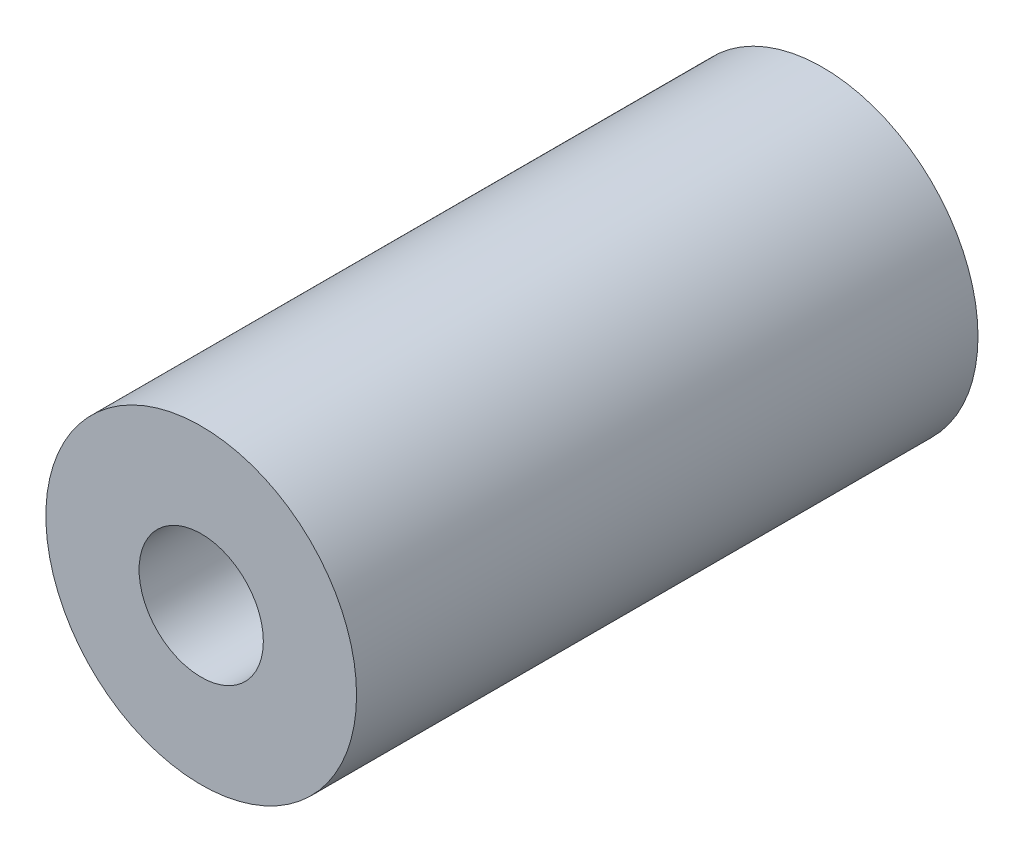
ISO-10303-21;
HEADER;
FILE_DESCRIPTION(('STEP AP214'),'2;1');
FILE_NAME('part.step','',(''),(''),'','','');
FILE_SCHEMA(('AUTOMOTIVE_DESIGN { 1 0 10303 214 1 1 1 1 }'));
ENDSEC;
DATA;
#1=APPLICATION_CONTEXT('core data for automotive mechanical design processes');
#2=APPLICATION_PROTOCOL_DEFINITION('international standard','automotive_design',2000,#1);
#3=PRODUCT_CONTEXT('',#1,'mechanical');
#4=PRODUCT('Part','Part','',(#3));
#5=PRODUCT_RELATED_PRODUCT_CATEGORY('part','',(#4));
#6=PRODUCT_DEFINITION_FORMATION('','',#4);
#7=PRODUCT_DEFINITION_CONTEXT('part definition',#1,'design');
#8=PRODUCT_DEFINITION('design','',#6,#7);
#9=PRODUCT_DEFINITION_SHAPE('','',#8);
#10=(LENGTH_UNIT() NAMED_UNIT(*) SI_UNIT(.MILLI.,.METRE.));
#11=(NAMED_UNIT(*) PLANE_ANGLE_UNIT() SI_UNIT($,.RADIAN.));
#12=(NAMED_UNIT(*) SI_UNIT($,.STERADIAN.) SOLID_ANGLE_UNIT());
#13=UNCERTAINTY_MEASURE_WITH_UNIT(LENGTH_MEASURE(1.E-05),#10,'distance_accuracy_value','');
#14=(GEOMETRIC_REPRESENTATION_CONTEXT(3) GLOBAL_UNCERTAINTY_ASSIGNED_CONTEXT((#13)) GLOBAL_UNIT_ASSIGNED_CONTEXT((#10,
#11,#12)) REPRESENTATION_CONTEXT('',''));
#15=CARTESIAN_POINT('',(0.,0.,0.));
#16=DIRECTION('',(0.,0.,1.));
#17=DIRECTION('',(1.,0.,0.));
#18=AXIS2_PLACEMENT_3D('',#15,#16,#17);
#19=CARTESIAN_POINT('',(0.,0.,31.75));
#20=DIRECTION('',(0.,0.,-1.));
#21=DIRECTION('',(-1.,0.,0.));
#22=AXIS2_PLACEMENT_3D('',#19,#20,#21);
#23=CYLINDRICAL_SURFACE('',#22,3.175);
#24=CARTESIAN_POINT('',(0.,0.,31.75));
#25=DIRECTION('',(0.,0.,1.));
#26=DIRECTION('',(1.,0.,0.));
#27=AXIS2_PLACEMENT_3D('',#24,#25,#26);
#28=CIRCLE('',#27,3.175);
#29=CARTESIAN_POINT('',(3.175,0.,31.75));
#30=VERTEX_POINT('',#29);
#31=EDGE_CURVE('E39',#30,#30,#28,.T.);
#32=ORIENTED_EDGE('',*,*,#31,.T.);
#33=EDGE_LOOP('',(#32));
#34=FACE_BOUND('',#33,.T.);
#35=CARTESIAN_POINT('',(0.,0.,0.));
#36=DIRECTION('',(0.,0.,1.));
#37=DIRECTION('',(1.,0.,0.));
#38=AXIS2_PLACEMENT_3D('',#35,#36,#37);
#39=CIRCLE('',#38,3.175);
#40=CARTESIAN_POINT('',(3.175,0.,0.));
#41=VERTEX_POINT('',#40);
#42=EDGE_CURVE('E45',#41,#41,#39,.T.);
#43=ORIENTED_EDGE('',*,*,#42,.F.);
#44=EDGE_LOOP('',(#43));
#45=FACE_BOUND('',#44,.T.);
#46=ADVANCED_FACE('F32',(#34,#45),#23,.F.);
#47=CARTESIAN_POINT('',(0.,0.,31.75));
#48=DIRECTION('',(0.,0.,-1.));
#49=DIRECTION('',(-1.,0.,0.));
#50=AXIS2_PLACEMENT_3D('',#47,#48,#49);
#51=CYLINDRICAL_SURFACE('',#50,7.9375);
#52=CARTESIAN_POINT('',(0.,0.,31.75));
#53=DIRECTION('',(0.,0.,1.));
#54=DIRECTION('',(1.,0.,0.));
#55=AXIS2_PLACEMENT_3D('',#52,#53,#54);
#56=CIRCLE('',#55,7.9375);
#57=CARTESIAN_POINT('',(7.9375,0.,31.75));
#58=VERTEX_POINT('',#57);
#59=EDGE_CURVE('E10',#58,#58,#56,.T.);
#60=ORIENTED_EDGE('',*,*,#59,.F.);
#61=EDGE_LOOP('',(#60));
#62=FACE_BOUND('',#61,.T.);
#63=CARTESIAN_POINT('',(0.,0.,0.));
#64=DIRECTION('',(0.,0.,1.));
#65=DIRECTION('',(1.,0.,0.));
#66=AXIS2_PLACEMENT_3D('',#63,#64,#65);
#67=CIRCLE('',#66,7.9375);
#68=CARTESIAN_POINT('',(7.9375,0.,0.));
#69=VERTEX_POINT('',#68);
#70=EDGE_CURVE('E35',#69,#69,#67,.T.);
#71=ORIENTED_EDGE('',*,*,#70,.T.);
#72=EDGE_LOOP('',(#71));
#73=FACE_BOUND('',#72,.T.);
#74=ADVANCED_FACE('F52',(#62,#73),#51,.T.);
#75=CARTESIAN_POINT('',(0.,0.,31.75));
#76=DIRECTION('',(0.,0.,1.));
#77=DIRECTION('',(1.,0.,0.));
#78=AXIS2_PLACEMENT_3D('',#75,#76,#77);
#79=PLANE('',#78);
#80=ORIENTED_EDGE('',*,*,#31,.F.);
#81=EDGE_LOOP('',(#80));
#82=FACE_BOUND('',#81,.T.);
#83=ORIENTED_EDGE('',*,*,#59,.T.);
#84=EDGE_LOOP('',(#83));
#85=FACE_BOUND('',#84,.T.);
#86=ADVANCED_FACE('F56',(#82,#85),#79,.T.);
#87=CARTESIAN_POINT('',(0.,0.,0.));
#88=DIRECTION('',(0.,0.,1.));
#89=DIRECTION('',(1.,0.,0.));
#90=AXIS2_PLACEMENT_3D('',#87,#88,#89);
#91=PLANE('',#90);
#92=ORIENTED_EDGE('',*,*,#42,.T.);
#93=EDGE_LOOP('',(#92));
#94=FACE_BOUND('',#93,.T.);
#95=ORIENTED_EDGE('',*,*,#70,.F.);
#96=EDGE_LOOP('',(#95));
#97=FACE_BOUND('',#96,.T.);
#98=ADVANCED_FACE('F54',(#94,#97),#91,.F.);
#99=CLOSED_SHELL('',(#46,#74,#86,#98));
#100=MANIFOLD_SOLID_BREP('B2',#99);
#101=ADVANCED_BREP_SHAPE_REPRESENTATION('',(#18,#100),#14);
#102=SHAPE_DEFINITION_REPRESENTATION(#9,#101);
ENDSEC;
END-ISO-10303-21;
